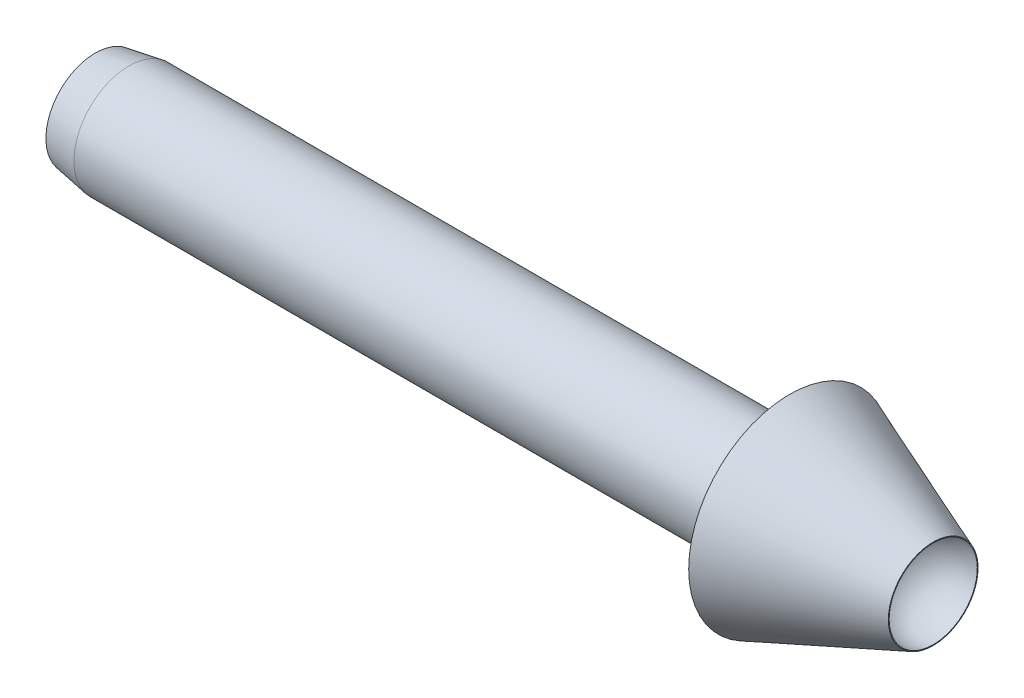
ISO-10303-21;
HEADER;
FILE_DESCRIPTION(('STEP AP214'),'2;1');
FILE_NAME('part.step','',(''),(''),'','','');
FILE_SCHEMA(('AUTOMOTIVE_DESIGN { 1 0 10303 214 1 1 1 1 }'));
ENDSEC;
DATA;
#1=APPLICATION_CONTEXT('core data for automotive mechanical design processes');
#2=APPLICATION_PROTOCOL_DEFINITION('international standard','automotive_design',2000,#1);
#3=PRODUCT_CONTEXT('',#1,'mechanical');
#4=PRODUCT('Part','Part','',(#3));
#5=PRODUCT_RELATED_PRODUCT_CATEGORY('part','',(#4));
#6=PRODUCT_DEFINITION_FORMATION('','',#4);
#7=PRODUCT_DEFINITION_CONTEXT('part definition',#1,'design');
#8=PRODUCT_DEFINITION('design','',#6,#7);
#9=PRODUCT_DEFINITION_SHAPE('','',#8);
#10=(LENGTH_UNIT() NAMED_UNIT(*) SI_UNIT(.MILLI.,.METRE.));
#11=(NAMED_UNIT(*) PLANE_ANGLE_UNIT() SI_UNIT($,.RADIAN.));
#12=(NAMED_UNIT(*) SI_UNIT($,.STERADIAN.) SOLID_ANGLE_UNIT());
#13=UNCERTAINTY_MEASURE_WITH_UNIT(LENGTH_MEASURE(1.E-05),#10,'distance_accuracy_value','');
#14=(GEOMETRIC_REPRESENTATION_CONTEXT(3) GLOBAL_UNCERTAINTY_ASSIGNED_CONTEXT((#13)) GLOBAL_UNIT_ASSIGNED_CONTEXT((#10,
#11,#12)) REPRESENTATION_CONTEXT('',''));
#15=CARTESIAN_POINT('',(0.,0.,0.));
#16=DIRECTION('',(0.,0.,1.));
#17=DIRECTION('',(1.,0.,0.));
#18=AXIS2_PLACEMENT_3D('',#15,#16,#17);
#19=CARTESIAN_POINT('',(0.,0.,0.));
#20=DIRECTION('',(1.,0.,0.));
#21=DIRECTION('',(0.,1.,0.));
#22=AXIS2_PLACEMENT_3D('',#19,#20,#21);
#23=CYLINDRICAL_SURFACE('',#22,0.375);
#24=CARTESIAN_POINT('',(-0.706664701255129,0.,0.));
#25=DIRECTION('',(1.,0.,0.));
#26=DIRECTION('',(0.,1.,0.));
#27=AXIS2_PLACEMENT_3D('',#24,#25,#26);
#28=CIRCLE('',#27,0.375);
#29=CARTESIAN_POINT('',(-0.706664701255129,0.375,0.));
#30=VERTEX_POINT('',#29);
#31=EDGE_CURVE('E19',#30,#30,#28,.T.);
#32=ORIENTED_EDGE('',*,*,#31,.T.);
#33=EDGE_LOOP('',(#32));
#34=FACE_BOUND('',#33,.T.);
#35=CARTESIAN_POINT('',(-3.80000000001246,0.,0.));
#36=DIRECTION('',(-1.,0.,0.));
#37=DIRECTION('',(0.,-1.,0.));
#38=AXIS2_PLACEMENT_3D('',#35,#36,#37);
#39=CIRCLE('',#38,0.375000000005343);
#40=CARTESIAN_POINT('',(-3.80000000001246,-0.375000000005343,0.));
#41=VERTEX_POINT('',#40);
#42=EDGE_CURVE('E45',#41,#41,#39,.T.);
#43=ORIENTED_EDGE('',*,*,#42,.T.);
#44=EDGE_LOOP('',(#43));
#45=FACE_BOUND('',#44,.T.);
#46=ADVANCED_FACE('F16',(#34,#45),#23,.F.);
#47=CARTESIAN_POINT('',(-5.79999999990832,0.,0.));
#48=DIRECTION('',(-1.,0.,0.));
#49=DIRECTION('',(0.,0.,1.));
#50=AXIS2_PLACEMENT_3D('',#47,#48,#49);
#51=CONICAL_SURFACE('',#50,0.745302251260682,0.183077886812723);
#52=CARTESIAN_POINT('',(-5.8,0.,0.));
#53=DIRECTION('',(1.,0.,0.));
#54=DIRECTION('',(0.,1.,0.));
#55=AXIS2_PLACEMENT_3D('',#52,#53,#54);
#56=CIRCLE('',#55,0.745302251276453);
#57=CARTESIAN_POINT('',(-5.8,0.745302251276453,0.));
#58=VERTEX_POINT('',#57);
#59=EDGE_CURVE('E44',#58,#58,#56,.F.);
#60=ORIENTED_EDGE('',*,*,#59,.T.);
#61=EDGE_LOOP('',(#60));
#62=FACE_BOUND('',#61,.T.);
#63=ORIENTED_EDGE('',*,*,#42,.F.);
#64=EDGE_LOOP('',(#63));
#65=FACE_BOUND('',#64,.T.);
#66=ADVANCED_FACE('F35',(#62,#65),#51,.F.);
#67=CARTESIAN_POINT('',(0.,0.,0.));
#68=DIRECTION('',(0.,1.,0.));
#69=DIRECTION('',(-1.,0.,0.));
#70=AXIS2_PLACEMENT_3D('',#67,#68,#69);
#71=SPHERICAL_SURFACE('',#70,0.8);
#72=CARTESIAN_POINT('',(0.,0.8,0.));
#73=VERTEX_POINT('',#72);
#74=VERTEX_LOOP('',#73);
#75=FACE_BOUND('',#74,.T.);
#76=CARTESIAN_POINT('',(0.15,0.785811682275086,0.));
#77=CARTESIAN_POINT('',(0.15,0.785817676993096,-0.0537359143924054));
#78=CARTESIAN_POINT('',(0.150000000000001,0.780281302111977,-0.107437998748114));
#79=CARTESIAN_POINT('',(0.149999999999999,0.760357662974171,-0.203241983617841));
#80=CARTESIAN_POINT('',(0.149999999999997,0.747713858364482,-0.245712346409613));
#81=CARTESIAN_POINT('',(0.150000000000003,0.715459439412774,-0.327980866185887));
#82=CARTESIAN_POINT('',(0.150000000000012,0.695841183904803,-0.367776035155031));
#83=CARTESIAN_POINT('',(0.149999999999988,0.650211780515486,-0.443483120249771));
#84=CARTESIAN_POINT('',(0.149999999999955,0.624204118148815,-0.479397138270727));
#85=CARTESIAN_POINT('',(0.150000000000045,0.566528567704552,-0.546349259257193));
#86=CARTESIAN_POINT('',(0.150000000000167,0.534860731520835,-0.577387406920988));
#87=CARTESIAN_POINT('',(0.150000000000167,0.466764274812937,-0.633706043926595));
#88=CARTESIAN_POINT('',(0.150000000000045,0.430335728654494,-0.65898662318888));
#89=CARTESIAN_POINT('',(0.149999999999955,0.353749935843746,-0.703074194423995));
#90=CARTESIAN_POINT('',(0.149999999999988,0.31359253858906,-0.721880924783811));
#91=CARTESIAN_POINT('',(0.150000000000012,0.230691080457852,-0.752485156634815));
#92=CARTESIAN_POINT('',(0.150000000000003,0.187947067908438,-0.764282789036181));
#93=CARTESIAN_POINT('',(0.149999999999997,0.101085207341552,-0.780534463573057));
#94=CARTESIAN_POINT('',(0.149999999999999,0.0569673635131587,-0.784988528098306));
#95=CARTESIAN_POINT('',(0.150000000000001,-0.0313899421765845,-0.786426692496738));
#96=CARTESIAN_POINT('',(0.15,-0.0756294041255571,-0.783410786986607));
#97=CARTESIAN_POINT('',(0.15,-0.162974158332985,-0.769994614086235));
#98=CARTESIAN_POINT('',(0.15,-0.206079448768053,-0.759594334825015));
#99=CARTESIAN_POINT('',(0.15,-0.289932684807995,-0.731704415709327));
#100=CARTESIAN_POINT('',(0.15,-0.330680600534775,-0.71421468602346));
#101=CARTESIAN_POINT('',(0.15,-0.408660698811081,-0.672643072800616));
#102=CARTESIAN_POINT('',(0.15,-0.445892976081081,-0.648561366936877));
#103=CARTESIAN_POINT('',(0.15,-0.51578619854607,-0.594488577790953));
#104=CARTESIAN_POINT('',(0.15,-0.548447135581306,-0.564497483960856));
#105=CARTESIAN_POINT('',(0.15,-0.608271252730914,-0.49945861068575));
#106=CARTESIAN_POINT('',(0.149999999999999,-0.635434304282826,-0.464410713025345));
#107=CARTESIAN_POINT('',(0.149999999999999,-0.683498749279395,-0.390232838009639));
#108=CARTESIAN_POINT('',(0.15,-0.704397935684847,-0.35110142838268));
#109=CARTESIAN_POINT('',(0.15,-0.739316563360474,-0.269936766923087));
#110=CARTESIAN_POINT('',(0.15,-0.753340995084598,-0.22790564537945));
#111=CARTESIAN_POINT('',(0.15,-0.77836500885903,-0.124503363871936));
#112=CARTESIAN_POINT('',(0.149999999999999,-0.785804740078308,-0.062228997457698));
#113=CARTESIAN_POINT('',(0.15,-0.785817676993095,0.0537359143924191));
#114=CARTESIAN_POINT('',(0.150000000000001,-0.780281302111975,0.107437998748127));
#115=CARTESIAN_POINT('',(0.149999999999999,-0.760357662974168,0.203241983617853));
#116=CARTESIAN_POINT('',(0.149999999999997,-0.747713858364478,0.245712346409625));
#117=CARTESIAN_POINT('',(0.150000000000003,-0.715459439412769,0.327980866185898));
#118=CARTESIAN_POINT('',(0.150000000000012,-0.695841183904797,0.367776035155042));
#119=CARTESIAN_POINT('',(0.149999999999988,-0.650211780515479,0.443483120249781));
#120=CARTESIAN_POINT('',(0.149999999999955,-0.624204118148808,0.479397138270737));
#121=CARTESIAN_POINT('',(0.150000000000045,-0.566528567704544,0.546349259257202));
#122=CARTESIAN_POINT('',(0.150000000000167,-0.534860731520825,0.577387406920996));
#123=CARTESIAN_POINT('',(0.150000000000167,-0.466764274812927,0.633706043926603));
#124=CARTESIAN_POINT('',(0.150000000000045,-0.430335728654484,0.658986623188887));
#125=CARTESIAN_POINT('',(0.149999999999955,-0.353749935843735,0.703074194424001));
#126=CARTESIAN_POINT('',(0.149999999999988,-0.313592538589048,0.721880924783817));
#127=CARTESIAN_POINT('',(0.150000000000012,-0.23069108045784,0.752485156634819));
#128=CARTESIAN_POINT('',(0.150000000000003,-0.187947067908426,0.764282789036184));
#129=CARTESIAN_POINT('',(0.149999999999997,-0.101085207341539,0.780534463573058));
#130=CARTESIAN_POINT('',(0.149999999999999,-0.0569673635131461,0.784988528098307));
#131=CARTESIAN_POINT('',(0.150000000000001,0.0313899421765972,0.786426692496737));
#132=CARTESIAN_POINT('',(0.15,0.0756294041255697,0.783410786986606));
#133=CARTESIAN_POINT('',(0.15,0.162974158332998,0.769994614086232));
#134=CARTESIAN_POINT('',(0.15,0.206079448768065,0.759594334825012));
#135=CARTESIAN_POINT('',(0.15,0.289932684808007,0.731704415709322));
#136=CARTESIAN_POINT('',(0.15,0.330680600534787,0.714214686023455));
#137=CARTESIAN_POINT('',(0.15,0.408660698811092,0.672643072800609));
#138=CARTESIAN_POINT('',(0.15,0.445892976081092,0.64856136693687));
#139=CARTESIAN_POINT('',(0.15,0.51578619854608,0.594488577790945));
#140=CARTESIAN_POINT('',(0.15,0.548447135581315,0.564497483960847));
#141=CARTESIAN_POINT('',(0.15,0.608271252730922,0.49945861068574));
#142=CARTESIAN_POINT('',(0.149999999999999,0.635434304282834,0.464410713025335));
#143=CARTESIAN_POINT('',(0.149999999999999,0.683498749279401,0.390232838009628));
#144=CARTESIAN_POINT('',(0.15,0.704397935684853,0.351101428382669));
#145=CARTESIAN_POINT('',(0.15,0.739316563360478,0.269936766923075));
#146=CARTESIAN_POINT('',(0.15,0.753340995084602,0.227905645379438));
#147=CARTESIAN_POINT('',(0.15,0.77836500885903,0.124503363871932));
#148=CARTESIAN_POINT('',(0.149999999999999,0.785804740078307,0.062228997457703));
#149=CARTESIAN_POINT('',(0.15,0.785811682275086,0.));
#150=B_SPLINE_CURVE_WITH_KNOTS('',3,(#76,#77,#78,#79,#80,#81,#82,#83,#84,#85,#86,#87,#88,#89,
#90,#91,#92,#93,#94,#95,#96,#97,#98,#99,#100,#101,#102,#103,#104,#105,#106,#107,#108,#109,#110,
#111,#112,#113,#114,#115,#116,#117,#118,#119,#120,#121,#122,#123,#124,#125,#126,#127,#128,#129,
#130,#131,#132,#133,#134,#135,#136,#137,#138,#139,#140,#141,#142,#143,#144,#145,#146,#147,#148,
#149),.UNSPECIFIED.,.T.,.F.,(4,2,2,2,2,2,2,2,2,2,2,2,2,2,2,2,2,2,2,2,2,2,2,2,2,2,2,2,2,2,2,2,2,
2,2,2,4),(0.,0.160844566668498,0.293169020670302,0.425638897592907,0.558036670104053,
0.690433228821917,0.822827719656813,0.955227560022934,1.08762492745577,1.22002189122269,
1.3524189504029,1.48481622242257,1.61721517211866,1.74961055362309,1.88200617144767,
2.0144048848515,2.14685019353681,2.27919921593175,2.4654656309258,2.6263101975943,
2.7586346515961,2.89110452851871,3.02350230102985,3.15589885974772,3.28829335058261,
3.42069319094874,3.55309055838157,3.68548752214849,3.8178845813287,3.95028185334837,
4.08268080304446,4.21507618454889,4.34747180237347,4.47987051577731,4.61231582446261,
4.74466484685755,4.93093126185158),.UNSPECIFIED.);
#151=CARTESIAN_POINT('',(0.15,0.785811682275086,0.));
#152=VERTEX_POINT('',#151);
#153=EDGE_CURVE('E39',#152,#152,#150,.T.);
#154=ORIENTED_EDGE('',*,*,#153,.F.);
#155=EDGE_LOOP('',(#154));
#156=FACE_BOUND('',#155,.T.);
#157=CARTESIAN_POINT('',(0.,-0.8,0.));
#158=VERTEX_POINT('',#157);
#159=VERTEX_LOOP('',#158);
#160=FACE_BOUND('',#159,.T.);
#161=ORIENTED_EDGE('',*,*,#31,.F.);
#162=EDGE_LOOP('',(#161));
#163=FACE_BOUND('',#162,.T.);
#164=ADVANCED_FACE('F31',(#75,#156,#160,#163),#71,.F.);
#165=CARTESIAN_POINT('',(0.,0.,0.));
#166=DIRECTION('',(1.,0.,0.));
#167=DIRECTION('',(0.,1.,0.));
#168=AXIS2_PLACEMENT_3D('',#165,#166,#167);
#169=CYLINDRICAL_SURFACE('',#168,0.745302251276453);
#170=ORIENTED_EDGE('',*,*,#59,.F.);
#171=EDGE_LOOP('',(#170));
#172=FACE_BOUND('',#171,.T.);
#173=CARTESIAN_POINT('',(-14.8,0.,0.));
#174=DIRECTION('',(1.,0.,0.));
#175=DIRECTION('',(0.,1.,0.));
#176=AXIS2_PLACEMENT_3D('',#173,#174,#175);
#177=CIRCLE('',#176,0.745302251276453);
#178=CARTESIAN_POINT('',(-14.8,0.745302251276452,0.));
#179=VERTEX_POINT('',#178);
#180=EDGE_CURVE('E63',#179,#179,#177,.T.);
#181=ORIENTED_EDGE('',*,*,#180,.F.);
#182=EDGE_LOOP('',(#181));
#183=FACE_BOUND('',#182,.T.);
#184=ADVANCED_FACE('F34',(#172,#183),#169,.F.);
#185=CARTESIAN_POINT('',(0.15,0.800199299935565,0.));
#186=DIRECTION('',(1.,0.,0.));
#187=DIRECTION('',(0.,1.,0.));
#188=AXIS2_PLACEMENT_3D('',#185,#186,#187);
#189=PLANE('',#188);
#190=ORIENTED_EDGE('',*,*,#153,.T.);
#191=EDGE_LOOP('',(#190));
#192=FACE_BOUND('',#191,.T.);
#193=CARTESIAN_POINT('',(0.15000000001919,0.,0.));
#194=DIRECTION('',(-1.,0.,0.));
#195=DIRECTION('',(0.,0.,1.));
#196=AXIS2_PLACEMENT_3D('',#193,#194,#195);
#197=CIRCLE('',#196,0.800199299918641);
#198=CARTESIAN_POINT('',(0.15000000001919,0.,0.800199299918641));
#199=VERTEX_POINT('',#198);
#200=EDGE_CURVE('E60',#199,#199,#197,.T.);
#201=ORIENTED_EDGE('',*,*,#200,.F.);
#202=EDGE_LOOP('',(#201));
#203=FACE_BOUND('',#202,.T.);
#204=ADVANCED_FACE('F70',(#192,#203),#189,.T.);
#205=CARTESIAN_POINT('',(-14.8,0.879999999999998,0.));
#206=DIRECTION('',(-1.,0.,0.));
#207=DIRECTION('',(0.,-1.,0.));
#208=AXIS2_PLACEMENT_3D('',#205,#206,#207);
#209=PLANE('',#208);
#210=CARTESIAN_POINT('',(-14.7999999999797,0.,0.));
#211=DIRECTION('',(1.,0.,0.));
#212=DIRECTION('',(0.,0.,-1.));
#213=AXIS2_PLACEMENT_3D('',#210,#211,#212);
#214=CIRCLE('',#213,0.88000000002353);
#215=CARTESIAN_POINT('',(-14.7999999999797,0.,-0.88000000002353));
#216=VERTEX_POINT('',#215);
#217=EDGE_CURVE('E57',#216,#216,#214,.T.);
#218=ORIENTED_EDGE('',*,*,#217,.F.);
#219=EDGE_LOOP('',(#218));
#220=FACE_BOUND('',#219,.T.);
#221=ORIENTED_EDGE('',*,*,#180,.T.);
#222=EDGE_LOOP('',(#221));
#223=FACE_BOUND('',#222,.T.);
#224=ADVANCED_FACE('F74',(#220,#223),#209,.T.);
#225=CARTESIAN_POINT('',(-2.41303434017937,0.,0.));
#226=DIRECTION('',(-1.,0.,0.));
#227=DIRECTION('',(0.,0.,1.));
#228=AXIS2_PLACEMENT_3D('',#225,#226,#227);
#229=CONICAL_SURFACE('',#228,1.79999999991764,0.37192966359257);
#230=CARTESIAN_POINT('',(-2.41303434029305,0.,0.));
#231=DIRECTION('',(-1.,0.,0.));
#232=DIRECTION('',(0.,0.,1.));
#233=AXIS2_PLACEMENT_3D('',#230,#231,#232);
#234=CIRCLE('',#233,1.79999999996199);
#235=CARTESIAN_POINT('',(-2.41303434029305,0.,1.79999999996199));
#236=VERTEX_POINT('',#235);
#237=EDGE_CURVE('E54',#236,#236,#234,.T.);
#238=ORIENTED_EDGE('',*,*,#237,.F.);
#239=EDGE_LOOP('',(#238));
#240=FACE_BOUND('',#239,.T.);
#241=ORIENTED_EDGE('',*,*,#200,.T.);
#242=EDGE_LOOP('',(#241));
#243=FACE_BOUND('',#242,.T.);
#244=ADVANCED_FACE('F98',(#240,#243),#229,.T.);
#245=CARTESIAN_POINT('',(-14.2000000000166,0.,0.));
#246=DIRECTION('',(1.,0.,0.));
#247=DIRECTION('',(0.,0.,-1.));
#248=AXIS2_PLACEMENT_3D('',#245,#246,#247);
#249=CONICAL_SURFACE('',#248,0.980000000012639,0.165148677406945);
#250=CARTESIAN_POINT('',(-14.2,0.,0.));
#251=DIRECTION('',(1.,0.,0.));
#252=DIRECTION('',(0.,1.,0.));
#253=AXIS2_PLACEMENT_3D('',#250,#251,#252);
#254=CIRCLE('',#253,0.98);
#255=CARTESIAN_POINT('',(-14.2,0.979999999999998,0.));
#256=VERTEX_POINT('',#255);
#257=EDGE_CURVE('E25',#256,#256,#254,.T.);
#258=ORIENTED_EDGE('',*,*,#257,.F.);
#259=EDGE_LOOP('',(#258));
#260=FACE_BOUND('',#259,.T.);
#261=ORIENTED_EDGE('',*,*,#217,.T.);
#262=EDGE_LOOP('',(#261));
#263=FACE_BOUND('',#262,.T.);
#264=ADVANCED_FACE('F92',(#260,#263),#249,.T.);
#265=CARTESIAN_POINT('',(-2.4130343403101,1.8,0.));
#266=DIRECTION('',(-1.,0.,0.));
#267=DIRECTION('',(0.,-1.,0.));
#268=AXIS2_PLACEMENT_3D('',#265,#266,#267);
#269=PLANE('',#268);
#270=ORIENTED_EDGE('',*,*,#237,.T.);
#271=EDGE_LOOP('',(#270));
#272=FACE_BOUND('',#271,.T.);
#273=CARTESIAN_POINT('',(-2.4130343403101,0.,0.));
#274=DIRECTION('',(1.,0.,0.));
#275=DIRECTION('',(0.,1.,0.));
#276=AXIS2_PLACEMENT_3D('',#273,#274,#275);
#277=CIRCLE('',#276,0.98);
#278=CARTESIAN_POINT('',(-2.4130343403101,0.98,0.));
#279=VERTEX_POINT('',#278);
#280=EDGE_CURVE('E10',#279,#279,#277,.F.);
#281=ORIENTED_EDGE('',*,*,#280,.F.);
#282=EDGE_LOOP('',(#281));
#283=FACE_BOUND('',#282,.T.);
#284=ADVANCED_FACE('F86',(#272,#283),#269,.T.);
#285=CARTESIAN_POINT('',(0.,0.,0.));
#286=DIRECTION('',(1.,0.,0.));
#287=DIRECTION('',(0.,1.,0.));
#288=AXIS2_PLACEMENT_3D('',#285,#286,#287);
#289=CYLINDRICAL_SURFACE('',#288,0.98);
#290=ORIENTED_EDGE('',*,*,#280,.T.);
#291=EDGE_LOOP('',(#290));
#292=FACE_BOUND('',#291,.T.);
#293=ORIENTED_EDGE('',*,*,#257,.T.);
#294=EDGE_LOOP('',(#293));
#295=FACE_BOUND('',#294,.T.);
#296=ADVANCED_FACE('F84',(#292,#295),#289,.T.);
#297=CLOSED_SHELL('',(#46,#66,#164,#184,#204,#224,#244,#264,#284,#296));
#298=MANIFOLD_SOLID_BREP('B1',#297);
#299=ADVANCED_BREP_SHAPE_REPRESENTATION('',(#18,#298),#14);
#300=SHAPE_DEFINITION_REPRESENTATION(#9,#299);
ENDSEC;
END-ISO-10303-21;
